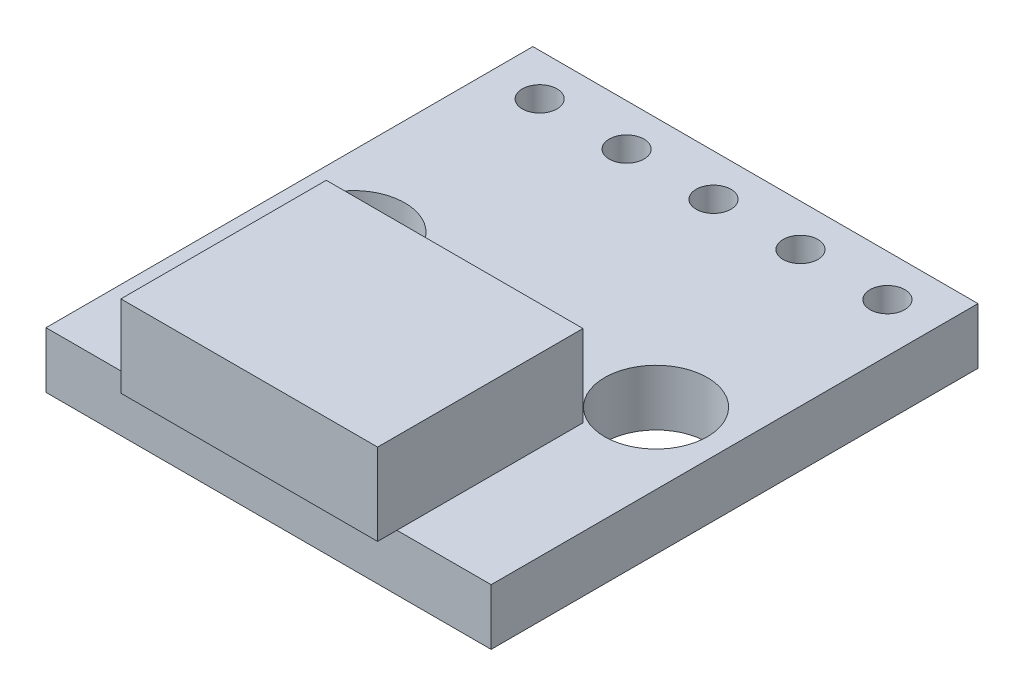
ISO-10303-21;
HEADER;
FILE_DESCRIPTION(('STEP AP214'),'2;1');
FILE_NAME('part.step','',(''),(''),'','','');
FILE_SCHEMA(('AUTOMOTIVE_DESIGN { 1 0 10303 214 1 1 1 1 }'));
ENDSEC;
DATA;
#1=APPLICATION_CONTEXT('core data for automotive mechanical design processes');
#2=APPLICATION_PROTOCOL_DEFINITION('international standard','automotive_design',2000,#1);
#3=PRODUCT_CONTEXT('',#1,'mechanical');
#4=PRODUCT('Part','Part','',(#3));
#5=PRODUCT_RELATED_PRODUCT_CATEGORY('part','',(#4));
#6=PRODUCT_DEFINITION_FORMATION('','',#4);
#7=PRODUCT_DEFINITION_CONTEXT('part definition',#1,'design');
#8=PRODUCT_DEFINITION('design','',#6,#7);
#9=PRODUCT_DEFINITION_SHAPE('','',#8);
#10=(LENGTH_UNIT() NAMED_UNIT(*) SI_UNIT(.MILLI.,.METRE.));
#11=(NAMED_UNIT(*) PLANE_ANGLE_UNIT() SI_UNIT($,.RADIAN.));
#12=(NAMED_UNIT(*) SI_UNIT($,.STERADIAN.) SOLID_ANGLE_UNIT());
#13=UNCERTAINTY_MEASURE_WITH_UNIT(LENGTH_MEASURE(1.E-05),#10,'distance_accuracy_value','');
#14=(GEOMETRIC_REPRESENTATION_CONTEXT(3) GLOBAL_UNCERTAINTY_ASSIGNED_CONTEXT((#13)) GLOBAL_UNIT_ASSIGNED_CONTEXT((#10,
#11,#12)) REPRESENTATION_CONTEXT('',''));
#15=CARTESIAN_POINT('',(0.,0.,0.));
#16=DIRECTION('',(0.,0.,1.));
#17=DIRECTION('',(1.,0.,0.));
#18=AXIS2_PLACEMENT_3D('',#15,#16,#17);
#19=CARTESIAN_POINT('',(0.,1.6383,0.));
#20=DIRECTION('',(0.,-1.,0.));
#21=DIRECTION('',(0.,0.,-1.));
#22=AXIS2_PLACEMENT_3D('',#19,#20,#21);
#23=PLANE('',#22);
#24=CARTESIAN_POINT('',(11.5824,1.6383,-13.));
#25=DIRECTION('',(0.,1.,0.));
#26=DIRECTION('',(0.,0.,1.));
#27=AXIS2_PLACEMENT_3D('',#24,#25,#26);
#28=CIRCLE('',#27,0.508);
#29=CARTESIAN_POINT('',(11.5824,1.6383,-12.492));
#30=VERTEX_POINT('',#29);
#31=EDGE_CURVE('E270',#30,#30,#28,.T.);
#32=ORIENTED_EDGE('',*,*,#31,.F.);
#33=EDGE_LOOP('',(#32));
#34=FACE_BOUND('',#33,.T.);
#35=CARTESIAN_POINT('',(9.0424,1.6383,-13.));
#36=DIRECTION('',(0.,1.,0.));
#37=DIRECTION('',(0.,0.,1.));
#38=AXIS2_PLACEMENT_3D('',#35,#36,#37);
#39=CIRCLE('',#38,0.508);
#40=CARTESIAN_POINT('',(9.0424,1.6383,-12.492));
#41=VERTEX_POINT('',#40);
#42=EDGE_CURVE('E276',#41,#41,#39,.T.);
#43=ORIENTED_EDGE('',*,*,#42,.F.);
#44=EDGE_LOOP('',(#43));
#45=FACE_BOUND('',#44,.T.);
#46=CARTESIAN_POINT('',(6.5024,1.6383,-13.));
#47=DIRECTION('',(0.,1.,0.));
#48=DIRECTION('',(0.,0.,1.));
#49=AXIS2_PLACEMENT_3D('',#46,#47,#48);
#50=CIRCLE('',#49,0.508);
#51=CARTESIAN_POINT('',(6.5024,1.6383,-12.492));
#52=VERTEX_POINT('',#51);
#53=EDGE_CURVE('E282',#52,#52,#50,.T.);
#54=ORIENTED_EDGE('',*,*,#53,.F.);
#55=EDGE_LOOP('',(#54));
#56=FACE_BOUND('',#55,.T.);
#57=CARTESIAN_POINT('',(3.9624,1.6383,-13.));
#58=DIRECTION('',(0.,1.,0.));
#59=DIRECTION('',(0.,0.,1.));
#60=AXIS2_PLACEMENT_3D('',#57,#58,#59);
#61=CIRCLE('',#60,0.508);
#62=CARTESIAN_POINT('',(3.9624,1.6383,-12.492));
#63=VERTEX_POINT('',#62);
#64=EDGE_CURVE('E290',#63,#63,#61,.T.);
#65=ORIENTED_EDGE('',*,*,#64,.F.);
#66=EDGE_LOOP('',(#65));
#67=FACE_BOUND('',#66,.T.);
#68=CARTESIAN_POINT('',(1.4224,1.6383,-13.));
#69=DIRECTION('',(0.,1.,0.));
#70=DIRECTION('',(0.,0.,1.));
#71=AXIS2_PLACEMENT_3D('',#68,#69,#70);
#72=CIRCLE('',#71,0.508);
#73=CARTESIAN_POINT('',(1.4224,1.6383,-12.492));
#74=VERTEX_POINT('',#73);
#75=EDGE_CURVE('E298',#74,#74,#72,.T.);
#76=ORIENTED_EDGE('',*,*,#75,.F.);
#77=EDGE_LOOP('',(#76));
#78=FACE_BOUND('',#77,.T.);
#79=CARTESIAN_POINT('',(2.0828,1.6383,-6.9));
#80=DIRECTION('',(0.,1.,0.));
#81=DIRECTION('',(0.,0.,1.));
#82=AXIS2_PLACEMENT_3D('',#79,#80,#81);
#83=CIRCLE('',#82,1.5);
#84=CARTESIAN_POINT('',(2.0828,1.6383,-5.4));
#85=VERTEX_POINT('',#84);
#86=EDGE_CURVE('E306',#85,#85,#83,.T.);
#87=ORIENTED_EDGE('',*,*,#86,.F.);
#88=EDGE_LOOP('',(#87));
#89=FACE_BOUND('',#88,.T.);
#90=CARTESIAN_POINT('',(10.922,1.6383,-6.9));
#91=DIRECTION('',(0.,1.,0.));
#92=DIRECTION('',(0.,0.,1.));
#93=AXIS2_PLACEMENT_3D('',#90,#91,#92);
#94=CIRCLE('',#93,1.5);
#95=CARTESIAN_POINT('',(10.922,1.6383,-5.4));
#96=VERTEX_POINT('',#95);
#97=EDGE_CURVE('E260',#96,#96,#94,.F.);
#98=ORIENTED_EDGE('',*,*,#97,.T.);
#99=EDGE_LOOP('',(#98));
#100=FACE_BOUND('',#99,.T.);
#101=DIRECTION('',(0.,0.,1.));
#102=VECTOR('',#101,1.);
#103=CARTESIAN_POINT('',(2.7524,1.6383,-5.4356));
#104=LINE('',#103,#102);
#105=CARTESIAN_POINT('',(2.7524,1.6383,-5.4356));
#106=VERTEX_POINT('',#105);
#107=CARTESIAN_POINT('',(2.7524,1.6383,0.));
#108=VERTEX_POINT('',#107);
#109=EDGE_CURVE('E166',#106,#108,#104,.T.);
#110=ORIENTED_EDGE('',*,*,#109,.F.);
#111=DIRECTION('',(-1.,0.,0.));
#112=VECTOR('',#111,1.);
#113=CARTESIAN_POINT('',(2.7524,1.6383,-5.4356));
#114=LINE('',#113,#112);
#115=CARTESIAN_POINT('',(10.2524,1.6383,-5.4356));
#116=VERTEX_POINT('',#115);
#117=EDGE_CURVE('E247',#116,#106,#114,.T.);
#118=ORIENTED_EDGE('',*,*,#117,.F.);
#119=DIRECTION('',(0.,0.,-1.));
#120=VECTOR('',#119,1.);
#121=CARTESIAN_POINT('',(10.2524,1.6383,-5.4356));
#122=LINE('',#121,#120);
#123=CARTESIAN_POINT('',(10.2524,1.6383,0.));
#124=VERTEX_POINT('',#123);
#125=EDGE_CURVE('E12',#124,#116,#122,.T.);
#126=ORIENTED_EDGE('',*,*,#125,.F.);
#127=DIRECTION('',(1.,0.,0.));
#128=VECTOR('',#127,1.);
#129=CARTESIAN_POINT('',(0.,1.6383,0.));
#130=LINE('',#129,#128);
#131=CARTESIAN_POINT('',(13.0048,1.6383,0.));
#132=VERTEX_POINT('',#131);
#133=EDGE_CURVE('E324',#124,#132,#130,.T.);
#134=ORIENTED_EDGE('',*,*,#133,.T.);
#135=DIRECTION('',(0.,0.,-1.));
#136=VECTOR('',#135,1.);
#137=CARTESIAN_POINT('',(13.0048,1.6383,0.));
#138=LINE('',#137,#136);
#139=CARTESIAN_POINT('',(13.0048,1.6383,-14.224));
#140=VERTEX_POINT('',#139);
#141=EDGE_CURVE('E322',#132,#140,#138,.T.);
#142=ORIENTED_EDGE('',*,*,#141,.T.);
#143=DIRECTION('',(1.,0.,0.));
#144=VECTOR('',#143,1.);
#145=CARTESIAN_POINT('',(0.,1.6383,-14.224));
#146=LINE('',#145,#144);
#147=CARTESIAN_POINT('',(0.,1.6383,-14.224));
#148=VERTEX_POINT('',#147);
#149=EDGE_CURVE('E318',#148,#140,#146,.T.);
#150=ORIENTED_EDGE('',*,*,#149,.F.);
#151=DIRECTION('',(0.,0.,-1.));
#152=VECTOR('',#151,1.);
#153=CARTESIAN_POINT('',(0.,1.6383,0.));
#154=LINE('',#153,#152);
#155=CARTESIAN_POINT('',(0.,1.6383,0.));
#156=VERTEX_POINT('',#155);
#157=EDGE_CURVE('E314',#156,#148,#154,.T.);
#158=ORIENTED_EDGE('',*,*,#157,.F.);
#159=EDGE_CURVE('E325',#156,#108,#130,.T.);
#160=ORIENTED_EDGE('',*,*,#159,.T.);
#161=EDGE_LOOP('',(#110,#118,#126,#134,#142,#150,#158,#160));
#162=FACE_BOUND('',#161,.T.);
#163=ADVANCED_FACE('F144',(#34,#45,#56,#67,#78,#89,#100,#162),#23,.F.);
#164=CARTESIAN_POINT('',(0.,0.,0.));
#165=DIRECTION('',(0.,-1.,0.));
#166=DIRECTION('',(0.,0.,-1.));
#167=AXIS2_PLACEMENT_3D('',#164,#165,#166);
#168=PLANE('',#167);
#169=CARTESIAN_POINT('',(10.922,0.,-6.9));
#170=DIRECTION('',(0.,1.,0.));
#171=DIRECTION('',(0.,0.,1.));
#172=AXIS2_PLACEMENT_3D('',#169,#170,#171);
#173=CIRCLE('',#172,1.5);
#174=CARTESIAN_POINT('',(10.922,0.,-5.4));
#175=VERTEX_POINT('',#174);
#176=EDGE_CURVE('E254',#175,#175,#173,.F.);
#177=ORIENTED_EDGE('',*,*,#176,.F.);
#178=EDGE_LOOP('',(#177));
#179=FACE_BOUND('',#178,.T.);
#180=CARTESIAN_POINT('',(9.0424,0.,-13.));
#181=DIRECTION('',(0.,1.,0.));
#182=DIRECTION('',(0.,0.,1.));
#183=AXIS2_PLACEMENT_3D('',#180,#181,#182);
#184=CIRCLE('',#183,0.508);
#185=CARTESIAN_POINT('',(9.0424,0.,-12.492));
#186=VERTEX_POINT('',#185);
#187=EDGE_CURVE('E273',#186,#186,#184,.T.);
#188=ORIENTED_EDGE('',*,*,#187,.T.);
#189=EDGE_LOOP('',(#188));
#190=FACE_BOUND('',#189,.T.);
#191=CARTESIAN_POINT('',(3.9624,0.,-13.));
#192=DIRECTION('',(0.,1.,0.));
#193=DIRECTION('',(0.,0.,1.));
#194=AXIS2_PLACEMENT_3D('',#191,#192,#193);
#195=CIRCLE('',#194,0.508);
#196=CARTESIAN_POINT('',(3.9624,0.,-12.492));
#197=VERTEX_POINT('',#196);
#198=EDGE_CURVE('E286',#197,#197,#195,.T.);
#199=ORIENTED_EDGE('',*,*,#198,.T.);
#200=EDGE_LOOP('',(#199));
#201=FACE_BOUND('',#200,.T.);
#202=CARTESIAN_POINT('',(2.0828,0.,-6.9));
#203=DIRECTION('',(0.,1.,0.));
#204=DIRECTION('',(0.,0.,1.));
#205=AXIS2_PLACEMENT_3D('',#202,#203,#204);
#206=CIRCLE('',#205,1.5);
#207=CARTESIAN_POINT('',(2.0828,0.,-5.4));
#208=VERTEX_POINT('',#207);
#209=EDGE_CURVE('E302',#208,#208,#206,.T.);
#210=ORIENTED_EDGE('',*,*,#209,.T.);
#211=EDGE_LOOP('',(#210));
#212=FACE_BOUND('',#211,.T.);
#213=DIRECTION('',(0.,0.,-1.));
#214=VECTOR('',#213,1.);
#215=CARTESIAN_POINT('',(0.,0.,0.));
#216=LINE('',#215,#214);
#217=CARTESIAN_POINT('',(0.,0.,0.));
#218=VERTEX_POINT('',#217);
#219=CARTESIAN_POINT('',(0.,0.,-14.224));
#220=VERTEX_POINT('',#219);
#221=EDGE_CURVE('E310',#218,#220,#216,.T.);
#222=ORIENTED_EDGE('',*,*,#221,.T.);
#223=DIRECTION('',(1.,0.,0.));
#224=VECTOR('',#223,1.);
#225=CARTESIAN_POINT('',(0.,0.,-14.224));
#226=LINE('',#225,#224);
#227=CARTESIAN_POINT('',(13.0048,0.,-14.224));
#228=VERTEX_POINT('',#227);
#229=EDGE_CURVE('E332',#220,#228,#226,.T.);
#230=ORIENTED_EDGE('',*,*,#229,.T.);
#231=DIRECTION('',(0.,0.,-1.));
#232=VECTOR('',#231,1.);
#233=CARTESIAN_POINT('',(13.0048,0.,0.));
#234=LINE('',#233,#232);
#235=CARTESIAN_POINT('',(13.0048,0.,0.));
#236=VERTEX_POINT('',#235);
#237=EDGE_CURVE('E336',#236,#228,#234,.T.);
#238=ORIENTED_EDGE('',*,*,#237,.F.);
#239=DIRECTION('',(1.,0.,0.));
#240=VECTOR('',#239,1.);
#241=CARTESIAN_POINT('',(0.,0.,0.));
#242=LINE('',#241,#240);
#243=EDGE_CURVE('E319',#218,#236,#242,.T.);
#244=ORIENTED_EDGE('',*,*,#243,.F.);
#245=EDGE_LOOP('',(#222,#230,#238,#244));
#246=FACE_BOUND('',#245,.T.);
#247=CARTESIAN_POINT('',(1.4224,0.,-13.));
#248=DIRECTION('',(0.,1.,0.));
#249=DIRECTION('',(0.,0.,1.));
#250=AXIS2_PLACEMENT_3D('',#247,#248,#249);
#251=CIRCLE('',#250,0.508);
#252=CARTESIAN_POINT('',(1.4224,0.,-12.492));
#253=VERTEX_POINT('',#252);
#254=EDGE_CURVE('E294',#253,#253,#251,.T.);
#255=ORIENTED_EDGE('',*,*,#254,.T.);
#256=EDGE_LOOP('',(#255));
#257=FACE_BOUND('',#256,.T.);
#258=CARTESIAN_POINT('',(6.5024,0.,-13.));
#259=DIRECTION('',(0.,1.,0.));
#260=DIRECTION('',(0.,0.,1.));
#261=AXIS2_PLACEMENT_3D('',#258,#259,#260);
#262=CIRCLE('',#261,0.508);
#263=CARTESIAN_POINT('',(6.5024,0.,-12.492));
#264=VERTEX_POINT('',#263);
#265=EDGE_CURVE('E279',#264,#264,#262,.T.);
#266=ORIENTED_EDGE('',*,*,#265,.T.);
#267=EDGE_LOOP('',(#266));
#268=FACE_BOUND('',#267,.T.);
#269=CARTESIAN_POINT('',(11.5824,0.,-13.));
#270=DIRECTION('',(0.,1.,0.));
#271=DIRECTION('',(0.,0.,1.));
#272=AXIS2_PLACEMENT_3D('',#269,#270,#271);
#273=CIRCLE('',#272,0.508);
#274=CARTESIAN_POINT('',(11.5824,0.,-12.492));
#275=VERTEX_POINT('',#274);
#276=EDGE_CURVE('E268',#275,#275,#273,.T.);
#277=ORIENTED_EDGE('',*,*,#276,.T.);
#278=EDGE_LOOP('',(#277));
#279=FACE_BOUND('',#278,.T.);
#280=ADVANCED_FACE('F357',(#179,#190,#201,#212,#246,#257,#268,#279),#168,.T.);
#281=CARTESIAN_POINT('',(0.,1.6383,0.));
#282=DIRECTION('',(-1.,0.,0.));
#283=DIRECTION('',(0.,0.,1.));
#284=AXIS2_PLACEMENT_3D('',#281,#282,#283);
#285=PLANE('',#284);
#286=ORIENTED_EDGE('',*,*,#221,.F.);
#287=DIRECTION('',(0.,-1.,0.));
#288=VECTOR('',#287,1.);
#289=CARTESIAN_POINT('',(0.,1.6383,0.));
#290=LINE('',#289,#288);
#291=EDGE_CURVE('E154',#156,#218,#290,.T.);
#292=ORIENTED_EDGE('',*,*,#291,.F.);
#293=ORIENTED_EDGE('',*,*,#157,.T.);
#294=DIRECTION('',(0.,-1.,0.));
#295=VECTOR('',#294,1.);
#296=CARTESIAN_POINT('',(0.,1.6383,-14.224));
#297=LINE('',#296,#295);
#298=EDGE_CURVE('E148',#148,#220,#297,.T.);
#299=ORIENTED_EDGE('',*,*,#298,.T.);
#300=EDGE_LOOP('',(#286,#292,#293,#299));
#301=FACE_BOUND('',#300,.T.);
#302=ADVANCED_FACE('F146',(#301),#285,.T.);
#303=CARTESIAN_POINT('',(0.,1.6383,0.));
#304=DIRECTION('',(0.,0.,-1.));
#305=DIRECTION('',(-1.,0.,0.));
#306=AXIS2_PLACEMENT_3D('',#303,#304,#305);
#307=PLANE('',#306);
#308=ORIENTED_EDGE('',*,*,#243,.T.);
#309=DIRECTION('',(0.,-1.,0.));
#310=VECTOR('',#309,1.);
#311=CARTESIAN_POINT('',(13.0048,1.6383,0.));
#312=LINE('',#311,#310);
#313=EDGE_CURVE('E343',#132,#236,#312,.T.);
#314=ORIENTED_EDGE('',*,*,#313,.F.);
#315=ORIENTED_EDGE('',*,*,#133,.F.);
#316=EDGE_CURVE('E328',#108,#124,#130,.T.);
#317=ORIENTED_EDGE('',*,*,#316,.F.);
#318=ORIENTED_EDGE('',*,*,#159,.F.);
#319=ORIENTED_EDGE('',*,*,#291,.T.);
#320=EDGE_LOOP('',(#308,#314,#315,#317,#318,#319));
#321=FACE_BOUND('',#320,.T.);
#322=ADVANCED_FACE('F361',(#321),#307,.F.);
#323=CARTESIAN_POINT('',(13.0048,1.6383,0.));
#324=DIRECTION('',(-1.,0.,0.));
#325=DIRECTION('',(0.,0.,1.));
#326=AXIS2_PLACEMENT_3D('',#323,#324,#325);
#327=PLANE('',#326);
#328=ORIENTED_EDGE('',*,*,#237,.T.);
#329=DIRECTION('',(0.,-1.,0.));
#330=VECTOR('',#329,1.);
#331=CARTESIAN_POINT('',(13.0048,1.6383,-14.224));
#332=LINE('',#331,#330);
#333=EDGE_CURVE('E345',#140,#228,#332,.T.);
#334=ORIENTED_EDGE('',*,*,#333,.F.);
#335=ORIENTED_EDGE('',*,*,#141,.F.);
#336=ORIENTED_EDGE('',*,*,#313,.T.);
#337=EDGE_LOOP('',(#328,#334,#335,#336));
#338=FACE_BOUND('',#337,.T.);
#339=ADVANCED_FACE('F365',(#338),#327,.F.);
#340=CARTESIAN_POINT('',(0.,1.6383,-14.224));
#341=DIRECTION('',(0.,0.,-1.));
#342=DIRECTION('',(-1.,0.,0.));
#343=AXIS2_PLACEMENT_3D('',#340,#341,#342);
#344=PLANE('',#343);
#345=ORIENTED_EDGE('',*,*,#229,.F.);
#346=ORIENTED_EDGE('',*,*,#298,.F.);
#347=ORIENTED_EDGE('',*,*,#149,.T.);
#348=ORIENTED_EDGE('',*,*,#333,.T.);
#349=EDGE_LOOP('',(#345,#346,#347,#348));
#350=FACE_BOUND('',#349,.T.);
#351=ADVANCED_FACE('F353',(#350),#344,.T.);
#352=CARTESIAN_POINT('',(2.0828,1.6383,-6.9));
#353=DIRECTION('',(0.,-1.,0.));
#354=DIRECTION('',(0.,0.,-1.));
#355=AXIS2_PLACEMENT_3D('',#352,#353,#354);
#356=CYLINDRICAL_SURFACE('',#355,1.5);
#357=ORIENTED_EDGE('',*,*,#86,.T.);
#358=EDGE_LOOP('',(#357));
#359=FACE_BOUND('',#358,.T.);
#360=ORIENTED_EDGE('',*,*,#209,.F.);
#361=EDGE_LOOP('',(#360));
#362=FACE_BOUND('',#361,.T.);
#363=ADVANCED_FACE('F412',(#359,#362),#356,.F.);
#364=CARTESIAN_POINT('',(1.4224,1.6383,-13.));
#365=DIRECTION('',(0.,-1.,0.));
#366=DIRECTION('',(0.,0.,-1.));
#367=AXIS2_PLACEMENT_3D('',#364,#365,#366);
#368=CYLINDRICAL_SURFACE('',#367,0.508);
#369=ORIENTED_EDGE('',*,*,#75,.T.);
#370=EDGE_LOOP('',(#369));
#371=FACE_BOUND('',#370,.T.);
#372=ORIENTED_EDGE('',*,*,#254,.F.);
#373=EDGE_LOOP('',(#372));
#374=FACE_BOUND('',#373,.T.);
#375=ADVANCED_FACE('F422',(#371,#374),#368,.F.);
#376=CARTESIAN_POINT('',(3.9624,1.6383,-13.));
#377=DIRECTION('',(0.,-1.,0.));
#378=DIRECTION('',(0.,0.,-1.));
#379=AXIS2_PLACEMENT_3D('',#376,#377,#378);
#380=CYLINDRICAL_SURFACE('',#379,0.508);
#381=ORIENTED_EDGE('',*,*,#64,.T.);
#382=EDGE_LOOP('',(#381));
#383=FACE_BOUND('',#382,.T.);
#384=ORIENTED_EDGE('',*,*,#198,.F.);
#385=EDGE_LOOP('',(#384));
#386=FACE_BOUND('',#385,.T.);
#387=ADVANCED_FACE('F427',(#383,#386),#380,.F.);
#388=CARTESIAN_POINT('',(6.5024,1.6383,-13.));
#389=DIRECTION('',(0.,-1.,0.));
#390=DIRECTION('',(0.,0.,-1.));
#391=AXIS2_PLACEMENT_3D('',#388,#389,#390);
#392=CYLINDRICAL_SURFACE('',#391,0.508);
#393=ORIENTED_EDGE('',*,*,#53,.T.);
#394=EDGE_LOOP('',(#393));
#395=FACE_BOUND('',#394,.T.);
#396=ORIENTED_EDGE('',*,*,#265,.F.);
#397=EDGE_LOOP('',(#396));
#398=FACE_BOUND('',#397,.T.);
#399=ADVANCED_FACE('F449',(#395,#398),#392,.F.);
#400=CARTESIAN_POINT('',(9.0424,1.6383,-13.));
#401=DIRECTION('',(0.,-1.,0.));
#402=DIRECTION('',(0.,0.,-1.));
#403=AXIS2_PLACEMENT_3D('',#400,#401,#402);
#404=CYLINDRICAL_SURFACE('',#403,0.508);
#405=ORIENTED_EDGE('',*,*,#42,.T.);
#406=EDGE_LOOP('',(#405));
#407=FACE_BOUND('',#406,.T.);
#408=ORIENTED_EDGE('',*,*,#187,.F.);
#409=EDGE_LOOP('',(#408));
#410=FACE_BOUND('',#409,.T.);
#411=ADVANCED_FACE('F455',(#407,#410),#404,.F.);
#412=CARTESIAN_POINT('',(11.5824,1.6383,-13.));
#413=DIRECTION('',(0.,-1.,0.));
#414=DIRECTION('',(0.,0.,-1.));
#415=AXIS2_PLACEMENT_3D('',#412,#413,#414);
#416=CYLINDRICAL_SURFACE('',#415,0.508);
#417=ORIENTED_EDGE('',*,*,#31,.T.);
#418=EDGE_LOOP('',(#417));
#419=FACE_BOUND('',#418,.T.);
#420=ORIENTED_EDGE('',*,*,#276,.F.);
#421=EDGE_LOOP('',(#420));
#422=FACE_BOUND('',#421,.T.);
#423=ADVANCED_FACE('F440',(#419,#422),#416,.F.);
#424=CARTESIAN_POINT('',(10.922,1.6383,-6.9));
#425=DIRECTION('',(0.,-1.,0.));
#426=DIRECTION('',(0.,0.,-1.));
#427=AXIS2_PLACEMENT_3D('',#424,#425,#426);
#428=CYLINDRICAL_SURFACE('',#427,1.5);
#429=ORIENTED_EDGE('',*,*,#97,.F.);
#430=EDGE_LOOP('',(#429));
#431=FACE_BOUND('',#430,.T.);
#432=ORIENTED_EDGE('',*,*,#176,.T.);
#433=EDGE_LOOP('',(#432));
#434=FACE_BOUND('',#433,.T.);
#435=ADVANCED_FACE('F437',(#431,#434),#428,.F.);
#436=CARTESIAN_POINT('',(0.,1.6383,0.));
#437=DIRECTION('',(0.,1.,0.));
#438=DIRECTION('',(0.,0.,1.));
#439=AXIS2_PLACEMENT_3D('',#436,#437,#438);
#440=PLANE('',#439);
#441=CARTESIAN_POINT('',(2.7524,1.6383,0.564399999999998));
#442=VERTEX_POINT('',#441);
#443=EDGE_CURVE('E251',#108,#442,#104,.T.);
#444=ORIENTED_EDGE('',*,*,#443,.F.);
#445=ORIENTED_EDGE('',*,*,#316,.T.);
#446=CARTESIAN_POINT('',(10.2524,1.6383,0.564399999999998));
#447=VERTEX_POINT('',#446);
#448=EDGE_CURVE('E156',#447,#124,#122,.T.);
#449=ORIENTED_EDGE('',*,*,#448,.F.);
#450=DIRECTION('',(1.,0.,0.));
#451=VECTOR('',#450,1.);
#452=CARTESIAN_POINT('',(2.7524,1.6383,0.564399999999998));
#453=LINE('',#452,#451);
#454=EDGE_CURVE('E377',#442,#447,#453,.T.);
#455=ORIENTED_EDGE('',*,*,#454,.F.);
#456=EDGE_LOOP('',(#444,#445,#449,#455));
#457=FACE_BOUND('',#456,.T.);
#458=ADVANCED_FACE('F372',(#457),#440,.F.);
#459=CARTESIAN_POINT('',(2.7524,4.0259,-5.4356));
#460=DIRECTION('',(1.,0.,0.));
#461=DIRECTION('',(0.,0.,-1.));
#462=AXIS2_PLACEMENT_3D('',#459,#460,#461);
#463=PLANE('',#462);
#464=ORIENTED_EDGE('',*,*,#109,.T.);
#465=ORIENTED_EDGE('',*,*,#443,.T.);
#466=DIRECTION('',(0.,-1.,0.));
#467=VECTOR('',#466,1.);
#468=CARTESIAN_POINT('',(2.7524,4.0259,0.564399999999998));
#469=LINE('',#468,#467);
#470=CARTESIAN_POINT('',(2.7524,4.0259,0.564399999999998));
#471=VERTEX_POINT('',#470);
#472=EDGE_CURVE('E230',#471,#442,#469,.T.);
#473=ORIENTED_EDGE('',*,*,#472,.F.);
#474=DIRECTION('',(0.,0.,1.));
#475=VECTOR('',#474,1.);
#476=CARTESIAN_POINT('',(2.7524,4.0259,-5.4356));
#477=LINE('',#476,#475);
#478=CARTESIAN_POINT('',(2.7524,4.0259,-5.4356));
#479=VERTEX_POINT('',#478);
#480=EDGE_CURVE('E237',#479,#471,#477,.T.);
#481=ORIENTED_EDGE('',*,*,#480,.F.);
#482=DIRECTION('',(0.,-1.,0.));
#483=VECTOR('',#482,1.);
#484=CARTESIAN_POINT('',(2.7524,4.0259,-5.4356));
#485=LINE('',#484,#483);
#486=EDGE_CURVE('E383',#479,#106,#485,.T.);
#487=ORIENTED_EDGE('',*,*,#486,.T.);
#488=EDGE_LOOP('',(#464,#465,#473,#481,#487));
#489=FACE_BOUND('',#488,.T.);
#490=ADVANCED_FACE('F249',(#489),#463,.F.);
#491=CARTESIAN_POINT('',(2.7524,4.0259,0.564399999999998));
#492=DIRECTION('',(0.,0.,-1.));
#493=DIRECTION('',(-1.,0.,0.));
#494=AXIS2_PLACEMENT_3D('',#491,#492,#493);
#495=PLANE('',#494);
#496=ORIENTED_EDGE('',*,*,#454,.T.);
#497=DIRECTION('',(0.,-1.,0.));
#498=VECTOR('',#497,1.);
#499=CARTESIAN_POINT('',(10.2524,4.0259,0.564399999999998));
#500=LINE('',#499,#498);
#501=CARTESIAN_POINT('',(10.2524,4.0259,0.564399999999998));
#502=VERTEX_POINT('',#501);
#503=EDGE_CURVE('E232',#502,#447,#500,.T.);
#504=ORIENTED_EDGE('',*,*,#503,.F.);
#505=DIRECTION('',(1.,0.,0.));
#506=VECTOR('',#505,1.);
#507=CARTESIAN_POINT('',(2.7524,4.0259,0.564399999999998));
#508=LINE('',#507,#506);
#509=EDGE_CURVE('E226',#471,#502,#508,.T.);
#510=ORIENTED_EDGE('',*,*,#509,.F.);
#511=ORIENTED_EDGE('',*,*,#472,.T.);
#512=EDGE_LOOP('',(#496,#504,#510,#511));
#513=FACE_BOUND('',#512,.T.);
#514=ADVANCED_FACE('F228',(#513),#495,.F.);
#515=CARTESIAN_POINT('',(10.2524,4.0259,-5.4356));
#516=DIRECTION('',(-1.,0.,0.));
#517=DIRECTION('',(0.,0.,1.));
#518=AXIS2_PLACEMENT_3D('',#515,#516,#517);
#519=PLANE('',#518);
#520=ORIENTED_EDGE('',*,*,#448,.T.);
#521=ORIENTED_EDGE('',*,*,#125,.T.);
#522=DIRECTION('',(0.,-1.,0.));
#523=VECTOR('',#522,1.);
#524=CARTESIAN_POINT('',(10.2524,4.0259,-5.4356));
#525=LINE('',#524,#523);
#526=CARTESIAN_POINT('',(10.2524,4.0259,-5.4356));
#527=VERTEX_POINT('',#526);
#528=EDGE_CURVE('E262',#527,#116,#525,.T.);
#529=ORIENTED_EDGE('',*,*,#528,.F.);
#530=DIRECTION('',(0.,0.,-1.));
#531=VECTOR('',#530,1.);
#532=CARTESIAN_POINT('',(10.2524,4.0259,-5.4356));
#533=LINE('',#532,#531);
#534=EDGE_CURVE('E236',#502,#527,#533,.T.);
#535=ORIENTED_EDGE('',*,*,#534,.F.);
#536=ORIENTED_EDGE('',*,*,#503,.T.);
#537=EDGE_LOOP('',(#520,#521,#529,#535,#536));
#538=FACE_BOUND('',#537,.T.);
#539=ADVANCED_FACE('F374',(#538),#519,.F.);
#540=CARTESIAN_POINT('',(2.7524,4.0259,-5.4356));
#541=DIRECTION('',(0.,0.,1.));
#542=DIRECTION('',(1.,0.,0.));
#543=AXIS2_PLACEMENT_3D('',#540,#541,#542);
#544=PLANE('',#543);
#545=ORIENTED_EDGE('',*,*,#117,.T.);
#546=ORIENTED_EDGE('',*,*,#486,.F.);
#547=DIRECTION('',(-1.,0.,0.));
#548=VECTOR('',#547,1.);
#549=CARTESIAN_POINT('',(2.7524,4.0259,-5.4356));
#550=LINE('',#549,#548);
#551=EDGE_CURVE('E242',#527,#479,#550,.T.);
#552=ORIENTED_EDGE('',*,*,#551,.F.);
#553=ORIENTED_EDGE('',*,*,#528,.T.);
#554=EDGE_LOOP('',(#545,#546,#552,#553));
#555=FACE_BOUND('',#554,.T.);
#556=ADVANCED_FACE('F388',(#555),#544,.F.);
#557=CARTESIAN_POINT('',(0.,4.0259,0.));
#558=DIRECTION('',(0.,1.,0.));
#559=DIRECTION('',(0.,0.,1.));
#560=AXIS2_PLACEMENT_3D('',#557,#558,#559);
#561=PLANE('',#560);
#562=ORIENTED_EDGE('',*,*,#480,.T.);
#563=ORIENTED_EDGE('',*,*,#509,.T.);
#564=ORIENTED_EDGE('',*,*,#534,.T.);
#565=ORIENTED_EDGE('',*,*,#551,.T.);
#566=EDGE_LOOP('',(#562,#563,#564,#565));
#567=FACE_BOUND('',#566,.T.);
#568=ADVANCED_FACE('F240',(#567),#561,.T.);
#569=CLOSED_SHELL('',(#163,#280,#302,#322,#339,#351,#363,#375,#387,#399,#411,#423,#435,#458,
#490,#514,#539,#556,#568));
#570=MANIFOLD_SOLID_BREP('B2',#569);
#571=ADVANCED_BREP_SHAPE_REPRESENTATION('',(#18,#570),#14);
#572=SHAPE_DEFINITION_REPRESENTATION(#9,#571);
ENDSEC;
END-ISO-10303-21;
